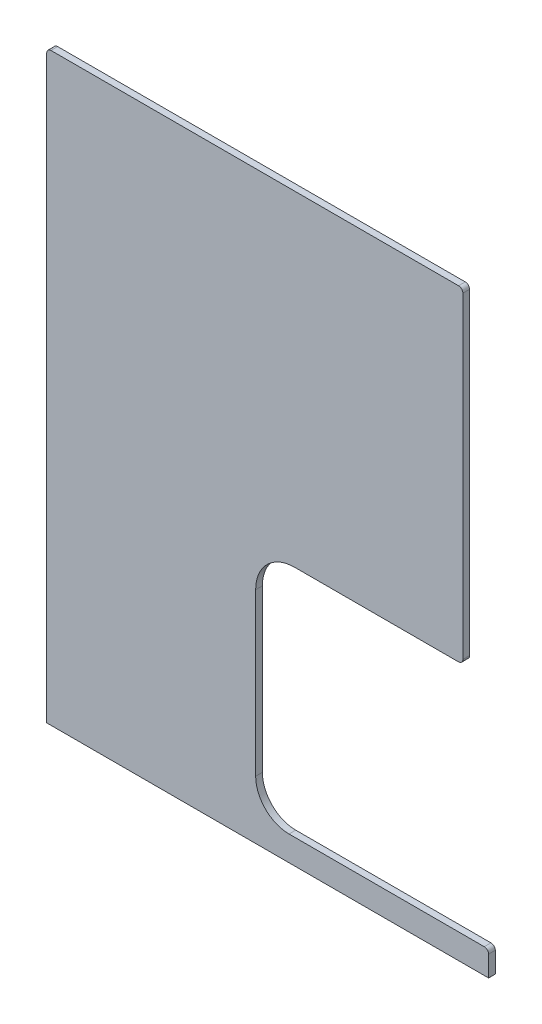
ISO-10303-21;
HEADER;
FILE_DESCRIPTION(('STEP AP214'),'2;1');
FILE_NAME('part.step','',(''),(''),'','','');
FILE_SCHEMA(('AUTOMOTIVE_DESIGN { 1 0 10303 214 1 1 1 1 }'));
ENDSEC;
DATA;
#1=APPLICATION_CONTEXT('core data for automotive mechanical design processes');
#2=APPLICATION_PROTOCOL_DEFINITION('international standard','automotive_design',2000,#1);
#3=PRODUCT_CONTEXT('',#1,'mechanical');
#4=PRODUCT('Part','Part','',(#3));
#5=PRODUCT_RELATED_PRODUCT_CATEGORY('part','',(#4));
#6=PRODUCT_DEFINITION_FORMATION('','',#4);
#7=PRODUCT_DEFINITION_CONTEXT('part definition',#1,'design');
#8=PRODUCT_DEFINITION('design','',#6,#7);
#9=PRODUCT_DEFINITION_SHAPE('','',#8);
#10=(LENGTH_UNIT() NAMED_UNIT(*) SI_UNIT(.MILLI.,.METRE.));
#11=(NAMED_UNIT(*) PLANE_ANGLE_UNIT() SI_UNIT($,.RADIAN.));
#12=(NAMED_UNIT(*) SI_UNIT($,.STERADIAN.) SOLID_ANGLE_UNIT());
#13=UNCERTAINTY_MEASURE_WITH_UNIT(LENGTH_MEASURE(1.E-05),#10,'distance_accuracy_value','');
#14=(GEOMETRIC_REPRESENTATION_CONTEXT(3) GLOBAL_UNCERTAINTY_ASSIGNED_CONTEXT((#13)) GLOBAL_UNIT_ASSIGNED_CONTEXT((#10,
#11,#12)) REPRESENTATION_CONTEXT('',''));
#15=CARTESIAN_POINT('',(0.,0.,0.));
#16=DIRECTION('',(0.,0.,1.));
#17=DIRECTION('',(1.,0.,0.));
#18=AXIS2_PLACEMENT_3D('',#15,#16,#17);
#19=CARTESIAN_POINT('',(0.,0.,8.6));
#20=DIRECTION('',(0.,1.,0.));
#21=DIRECTION('',(0.,0.,1.));
#22=AXIS2_PLACEMENT_3D('',#19,#20,#21);
#23=PLANE('',#22);
#24=DIRECTION('',(1.,0.,0.));
#25=VECTOR('',#24,1.);
#26=CARTESIAN_POINT('',(0.,0.,0.));
#27=LINE('',#26,#25);
#28=CARTESIAN_POINT('',(0.,0.,0.));
#29=VERTEX_POINT('',#28);
#30=CARTESIAN_POINT('',(567.,0.,0.));
#31=VERTEX_POINT('',#30);
#32=EDGE_CURVE('E165',#29,#31,#27,.T.);
#33=ORIENTED_EDGE('',*,*,#32,.T.);
#34=DIRECTION('',(0.,0.,-1.));
#35=VECTOR('',#34,1.);
#36=CARTESIAN_POINT('',(567.,0.,8.6));
#37=LINE('',#36,#35);
#38=CARTESIAN_POINT('',(567.,0.,8.6));
#39=VERTEX_POINT('',#38);
#40=EDGE_CURVE('E11',#39,#31,#37,.T.);
#41=ORIENTED_EDGE('',*,*,#40,.F.);
#42=DIRECTION('',(1.,0.,0.));
#43=VECTOR('',#42,1.);
#44=CARTESIAN_POINT('',(0.,0.,8.6));
#45=LINE('',#44,#43);
#46=CARTESIAN_POINT('',(0.,0.,8.6));
#47=VERTEX_POINT('',#46);
#48=EDGE_CURVE('E192',#47,#39,#45,.T.);
#49=ORIENTED_EDGE('',*,*,#48,.F.);
#50=DIRECTION('',(0.,0.,-1.));
#51=VECTOR('',#50,1.);
#52=CARTESIAN_POINT('',(0.,0.,8.6));
#53=LINE('',#52,#51);
#54=EDGE_CURVE('E161',#47,#29,#53,.T.);
#55=ORIENTED_EDGE('',*,*,#54,.T.);
#56=EDGE_LOOP('',(#33,#41,#49,#55));
#57=FACE_BOUND('',#56,.T.);
#58=ADVANCED_FACE('F33',(#57),#23,.F.);
#59=CARTESIAN_POINT('',(567.,0.,8.6));
#60=DIRECTION('',(-1.,0.,0.));
#61=DIRECTION('',(0.,0.,1.));
#62=AXIS2_PLACEMENT_3D('',#59,#60,#61);
#63=PLANE('',#62);
#64=DIRECTION('',(0.,1.,0.));
#65=VECTOR('',#64,1.);
#66=CARTESIAN_POINT('',(567.,0.,0.));
#67=LINE('',#66,#65);
#68=CARTESIAN_POINT('',(567.,26.4999999999999,0.));
#69=VERTEX_POINT('',#68);
#70=EDGE_CURVE('E168',#31,#69,#67,.T.);
#71=ORIENTED_EDGE('',*,*,#70,.T.);
#72=DIRECTION('',(0.,0.,-1.));
#73=VECTOR('',#72,1.);
#74=CARTESIAN_POINT('',(567.,26.4999999999999,8.6));
#75=LINE('',#74,#73);
#76=CARTESIAN_POINT('',(567.,26.4999999999999,8.6));
#77=VERTEX_POINT('',#76);
#78=EDGE_CURVE('E41',#77,#69,#75,.T.);
#79=ORIENTED_EDGE('',*,*,#78,.F.);
#80=DIRECTION('',(0.,1.,0.));
#81=VECTOR('',#80,1.);
#82=CARTESIAN_POINT('',(567.,0.,8.6));
#83=LINE('',#82,#81);
#84=EDGE_CURVE('E110',#39,#77,#83,.T.);
#85=ORIENTED_EDGE('',*,*,#84,.F.);
#86=ORIENTED_EDGE('',*,*,#40,.T.);
#87=EDGE_LOOP('',(#71,#79,#85,#86));
#88=FACE_BOUND('',#87,.T.);
#89=ADVANCED_FACE('F279',(#88),#63,.F.);
#90=CARTESIAN_POINT('',(561.5,26.5,8.6));
#91=DIRECTION('',(0.,0.,-1.));
#92=DIRECTION('',(-1.,0.,0.));
#93=AXIS2_PLACEMENT_3D('',#90,#91,#92);
#94=CYLINDRICAL_SURFACE('',#93,5.49999999999997);
#95=CARTESIAN_POINT('',(561.5,26.5,0.));
#96=DIRECTION('',(0.,0.,1.));
#97=DIRECTION('',(1.,0.,0.));
#98=AXIS2_PLACEMENT_3D('',#95,#96,#97);
#99=CIRCLE('',#98,5.49999999999997);
#100=CARTESIAN_POINT('',(561.5,32.,0.));
#101=VERTEX_POINT('',#100);
#102=EDGE_CURVE('E170',#69,#101,#99,.T.);
#103=ORIENTED_EDGE('',*,*,#102,.T.);
#104=DIRECTION('',(0.,0.,-1.));
#105=VECTOR('',#104,1.);
#106=CARTESIAN_POINT('',(561.5,32.,8.6));
#107=LINE('',#106,#105);
#108=CARTESIAN_POINT('',(561.5,32.,8.6));
#109=VERTEX_POINT('',#108);
#110=EDGE_CURVE('E217',#109,#101,#107,.T.);
#111=ORIENTED_EDGE('',*,*,#110,.F.);
#112=CARTESIAN_POINT('',(561.5,26.5,8.6));
#113=DIRECTION('',(0.,0.,1.));
#114=DIRECTION('',(1.,0.,0.));
#115=AXIS2_PLACEMENT_3D('',#112,#113,#114);
#116=CIRCLE('',#115,5.49999999999997);
#117=EDGE_CURVE('E225',#77,#109,#116,.T.);
#118=ORIENTED_EDGE('',*,*,#117,.F.);
#119=ORIENTED_EDGE('',*,*,#78,.T.);
#120=EDGE_LOOP('',(#103,#111,#118,#119));
#121=FACE_BOUND('',#120,.T.);
#122=ADVANCED_FACE('F223',(#121),#94,.T.);
#123=CARTESIAN_POINT('',(313.,32.,8.6));
#124=DIRECTION('',(0.,-1.,0.));
#125=DIRECTION('',(1.,0.,0.));
#126=AXIS2_PLACEMENT_3D('',#123,#124,#125);
#127=PLANE('',#126);
#128=DIRECTION('',(-1.,0.,0.));
#129=VECTOR('',#128,1.);
#130=CARTESIAN_POINT('',(313.,32.,0.));
#131=LINE('',#130,#129);
#132=CARTESIAN_POINT('',(310.9,32.,0.));
#133=VERTEX_POINT('',#132);
#134=EDGE_CURVE('E173',#101,#133,#131,.T.);
#135=ORIENTED_EDGE('',*,*,#134,.T.);
#136=DIRECTION('',(0.,0.,-1.));
#137=VECTOR('',#136,1.);
#138=CARTESIAN_POINT('',(310.9,32.,8.6));
#139=LINE('',#138,#137);
#140=CARTESIAN_POINT('',(310.9,32.,8.6));
#141=VERTEX_POINT('',#140);
#142=EDGE_CURVE('E214',#141,#133,#139,.T.);
#143=ORIENTED_EDGE('',*,*,#142,.F.);
#144=DIRECTION('',(-1.,0.,0.));
#145=VECTOR('',#144,1.);
#146=CARTESIAN_POINT('',(561.5,32.,8.6));
#147=LINE('',#146,#145);
#148=EDGE_CURVE('E242',#109,#141,#147,.T.);
#149=ORIENTED_EDGE('',*,*,#148,.F.);
#150=ORIENTED_EDGE('',*,*,#110,.T.);
#151=EDGE_LOOP('',(#135,#143,#149,#150));
#152=FACE_BOUND('',#151,.T.);
#153=ADVANCED_FACE('F233',(#152),#127,.F.);
#154=CARTESIAN_POINT('',(310.9,74.8,8.6));
#155=DIRECTION('',(0.,0.,-1.));
#156=DIRECTION('',(-1.,0.,0.));
#157=AXIS2_PLACEMENT_3D('',#154,#155,#156);
#158=CYLINDRICAL_SURFACE('',#157,42.8);
#159=CARTESIAN_POINT('',(310.9,74.8,0.));
#160=DIRECTION('',(0.,0.,-1.));
#161=DIRECTION('',(-1.,0.,0.));
#162=AXIS2_PLACEMENT_3D('',#159,#160,#161);
#163=CIRCLE('',#162,42.8);
#164=CARTESIAN_POINT('',(268.1,74.8000000000001,0.));
#165=VERTEX_POINT('',#164);
#166=EDGE_CURVE('E175',#133,#165,#163,.T.);
#167=ORIENTED_EDGE('',*,*,#166,.T.);
#168=DIRECTION('',(0.,0.,-1.));
#169=VECTOR('',#168,1.);
#170=CARTESIAN_POINT('',(268.1,74.8000000000001,8.6));
#171=LINE('',#170,#169);
#172=CARTESIAN_POINT('',(268.1,74.8000000000001,8.6));
#173=VERTEX_POINT('',#172);
#174=EDGE_CURVE('E211',#173,#165,#171,.T.);
#175=ORIENTED_EDGE('',*,*,#174,.F.);
#176=CARTESIAN_POINT('',(310.9,74.8,8.6));
#177=DIRECTION('',(0.,0.,-1.));
#178=DIRECTION('',(-1.,0.,0.));
#179=AXIS2_PLACEMENT_3D('',#176,#177,#178);
#180=CIRCLE('',#179,42.8);
#181=EDGE_CURVE('E239',#141,#173,#180,.T.);
#182=ORIENTED_EDGE('',*,*,#181,.F.);
#183=ORIENTED_EDGE('',*,*,#142,.T.);
#184=EDGE_LOOP('',(#167,#175,#182,#183));
#185=FACE_BOUND('',#184,.T.);
#186=ADVANCED_FACE('F237',(#185),#158,.F.);
#187=CARTESIAN_POINT('',(268.1,282.,8.6));
#188=DIRECTION('',(-1.,0.,0.));
#189=DIRECTION('',(0.,0.,1.));
#190=AXIS2_PLACEMENT_3D('',#187,#188,#189);
#191=PLANE('',#190);
#192=DIRECTION('',(0.,1.,0.));
#193=VECTOR('',#192,1.);
#194=CARTESIAN_POINT('',(268.1,282.,0.));
#195=LINE('',#194,#193);
#196=CARTESIAN_POINT('',(268.1,282.,0.));
#197=VERTEX_POINT('',#196);
#198=EDGE_CURVE('E177',#165,#197,#195,.T.);
#199=ORIENTED_EDGE('',*,*,#198,.T.);
#200=DIRECTION('',(0.,0.,-1.));
#201=VECTOR('',#200,1.);
#202=CARTESIAN_POINT('',(268.1,282.,8.6));
#203=LINE('',#202,#201);
#204=CARTESIAN_POINT('',(268.1,282.,8.6));
#205=VERTEX_POINT('',#204);
#206=EDGE_CURVE('E208',#205,#197,#203,.T.);
#207=ORIENTED_EDGE('',*,*,#206,.F.);
#208=DIRECTION('',(0.,1.,0.));
#209=VECTOR('',#208,1.);
#210=CARTESIAN_POINT('',(268.1,282.,8.6));
#211=LINE('',#210,#209);
#212=EDGE_CURVE('E241',#173,#205,#211,.T.);
#213=ORIENTED_EDGE('',*,*,#212,.F.);
#214=ORIENTED_EDGE('',*,*,#174,.T.);
#215=EDGE_LOOP('',(#199,#207,#213,#214));
#216=FACE_BOUND('',#215,.T.);
#217=ADVANCED_FACE('F292',(#216),#191,.F.);
#218=CARTESIAN_POINT('',(318.1,282.,8.6));
#219=DIRECTION('',(0.,0.,-1.));
#220=DIRECTION('',(-1.,0.,0.));
#221=AXIS2_PLACEMENT_3D('',#218,#219,#220);
#222=CYLINDRICAL_SURFACE('',#221,50.0000000000001);
#223=CARTESIAN_POINT('',(318.1,282.,0.));
#224=DIRECTION('',(0.,0.,-1.));
#225=DIRECTION('',(1.,0.,0.));
#226=AXIS2_PLACEMENT_3D('',#223,#224,#225);
#227=CIRCLE('',#226,50.0000000000001);
#228=CARTESIAN_POINT('',(318.1,332.,0.));
#229=VERTEX_POINT('',#228);
#230=EDGE_CURVE('E179',#197,#229,#227,.T.);
#231=ORIENTED_EDGE('',*,*,#230,.T.);
#232=DIRECTION('',(0.,0.,-1.));
#233=VECTOR('',#232,1.);
#234=CARTESIAN_POINT('',(318.1,332.,8.6));
#235=LINE('',#234,#233);
#236=CARTESIAN_POINT('',(318.1,332.,8.6));
#237=VERTEX_POINT('',#236);
#238=EDGE_CURVE('E205',#237,#229,#235,.T.);
#239=ORIENTED_EDGE('',*,*,#238,.F.);
#240=CARTESIAN_POINT('',(318.1,282.,8.6));
#241=DIRECTION('',(0.,0.,-1.));
#242=DIRECTION('',(1.,0.,0.));
#243=AXIS2_PLACEMENT_3D('',#240,#241,#242);
#244=CIRCLE('',#243,50.0000000000001);
#245=EDGE_CURVE('E244',#205,#237,#244,.T.);
#246=ORIENTED_EDGE('',*,*,#245,.F.);
#247=ORIENTED_EDGE('',*,*,#206,.T.);
#248=EDGE_LOOP('',(#231,#239,#246,#247));
#249=FACE_BOUND('',#248,.T.);
#250=ADVANCED_FACE('F295',(#249),#222,.F.);
#251=CARTESIAN_POINT('',(528.5,332.,8.6));
#252=DIRECTION('',(0.,1.,0.));
#253=DIRECTION('',(0.,0.,1.));
#254=AXIS2_PLACEMENT_3D('',#251,#252,#253);
#255=PLANE('',#254);
#256=DIRECTION('',(1.,0.,0.));
#257=VECTOR('',#256,1.);
#258=CARTESIAN_POINT('',(528.5,332.,0.));
#259=LINE('',#258,#257);
#260=CARTESIAN_POINT('',(528.5,332.,0.));
#261=VERTEX_POINT('',#260);
#262=EDGE_CURVE('E181',#229,#261,#259,.T.);
#263=ORIENTED_EDGE('',*,*,#262,.T.);
#264=DIRECTION('',(0.,0.,-1.));
#265=VECTOR('',#264,1.);
#266=CARTESIAN_POINT('',(528.5,332.,8.6));
#267=LINE('',#266,#265);
#268=CARTESIAN_POINT('',(528.5,332.,8.6));
#269=VERTEX_POINT('',#268);
#270=EDGE_CURVE('E202',#269,#261,#267,.T.);
#271=ORIENTED_EDGE('',*,*,#270,.F.);
#272=DIRECTION('',(1.,0.,0.));
#273=VECTOR('',#272,1.);
#274=CARTESIAN_POINT('',(528.5,332.,8.6));
#275=LINE('',#274,#273);
#276=EDGE_CURVE('E250',#237,#269,#275,.T.);
#277=ORIENTED_EDGE('',*,*,#276,.F.);
#278=ORIENTED_EDGE('',*,*,#238,.T.);
#279=EDGE_LOOP('',(#263,#271,#277,#278));
#280=FACE_BOUND('',#279,.T.);
#281=ADVANCED_FACE('F299',(#280),#255,.F.);
#282=CARTESIAN_POINT('',(528.5,337.5,8.6));
#283=DIRECTION('',(0.,0.,-1.));
#284=DIRECTION('',(-1.,0.,0.));
#285=AXIS2_PLACEMENT_3D('',#282,#283,#284);
#286=CYLINDRICAL_SURFACE('',#285,5.49999999999998);
#287=CARTESIAN_POINT('',(528.5,337.5,0.));
#288=DIRECTION('',(0.,0.,1.));
#289=DIRECTION('',(-1.,0.,0.));
#290=AXIS2_PLACEMENT_3D('',#287,#288,#289);
#291=CIRCLE('',#290,5.49999999999998);
#292=CARTESIAN_POINT('',(534.,337.5,0.));
#293=VERTEX_POINT('',#292);
#294=EDGE_CURVE('E183',#261,#293,#291,.T.);
#295=ORIENTED_EDGE('',*,*,#294,.T.);
#296=DIRECTION('',(0.,0.,-1.));
#297=VECTOR('',#296,1.);
#298=CARTESIAN_POINT('',(534.,337.5,8.6));
#299=LINE('',#298,#297);
#300=CARTESIAN_POINT('',(534.,337.5,8.6));
#301=VERTEX_POINT('',#300);
#302=EDGE_CURVE('E199',#301,#293,#299,.T.);
#303=ORIENTED_EDGE('',*,*,#302,.F.);
#304=CARTESIAN_POINT('',(528.5,337.5,8.6));
#305=DIRECTION('',(0.,0.,1.));
#306=DIRECTION('',(-1.,0.,0.));
#307=AXIS2_PLACEMENT_3D('',#304,#305,#306);
#308=CIRCLE('',#307,5.49999999999998);
#309=EDGE_CURVE('E252',#269,#301,#308,.T.);
#310=ORIENTED_EDGE('',*,*,#309,.F.);
#311=ORIENTED_EDGE('',*,*,#270,.T.);
#312=EDGE_LOOP('',(#295,#303,#310,#311));
#313=FACE_BOUND('',#312,.T.);
#314=ADVANCED_FACE('F303',(#313),#286,.T.);
#315=CARTESIAN_POINT('',(534.,744.5,8.6));
#316=DIRECTION('',(-1.,0.,0.));
#317=DIRECTION('',(0.,0.,1.));
#318=AXIS2_PLACEMENT_3D('',#315,#316,#317);
#319=PLANE('',#318);
#320=DIRECTION('',(0.,1.,0.));
#321=VECTOR('',#320,1.);
#322=CARTESIAN_POINT('',(534.,744.5,0.));
#323=LINE('',#322,#321);
#324=CARTESIAN_POINT('',(534.,744.5,0.));
#325=VERTEX_POINT('',#324);
#326=EDGE_CURVE('E185',#293,#325,#323,.T.);
#327=ORIENTED_EDGE('',*,*,#326,.T.);
#328=DIRECTION('',(0.,0.,-1.));
#329=VECTOR('',#328,1.);
#330=CARTESIAN_POINT('',(534.,744.5,8.6));
#331=LINE('',#330,#329);
#332=CARTESIAN_POINT('',(534.,744.5,8.6));
#333=VERTEX_POINT('',#332);
#334=EDGE_CURVE('E196',#333,#325,#331,.T.);
#335=ORIENTED_EDGE('',*,*,#334,.F.);
#336=DIRECTION('',(0.,1.,0.));
#337=VECTOR('',#336,1.);
#338=CARTESIAN_POINT('',(534.,744.5,8.6));
#339=LINE('',#338,#337);
#340=EDGE_CURVE('E254',#301,#333,#339,.T.);
#341=ORIENTED_EDGE('',*,*,#340,.F.);
#342=ORIENTED_EDGE('',*,*,#302,.T.);
#343=EDGE_LOOP('',(#327,#335,#341,#342));
#344=FACE_BOUND('',#343,.T.);
#345=ADVANCED_FACE('F260',(#344),#319,.F.);
#346=CARTESIAN_POINT('',(528.5,744.5,8.6));
#347=DIRECTION('',(0.,0.,-1.));
#348=DIRECTION('',(-1.,0.,0.));
#349=AXIS2_PLACEMENT_3D('',#346,#347,#348);
#350=CYLINDRICAL_SURFACE('',#349,5.49999999999995);
#351=CARTESIAN_POINT('',(528.5,744.5,0.));
#352=DIRECTION('',(0.,0.,1.));
#353=DIRECTION('',(-1.,0.,0.));
#354=AXIS2_PLACEMENT_3D('',#351,#352,#353);
#355=CIRCLE('',#354,5.49999999999995);
#356=CARTESIAN_POINT('',(528.5,750.,0.));
#357=VERTEX_POINT('',#356);
#358=EDGE_CURVE('E187',#325,#357,#355,.T.);
#359=ORIENTED_EDGE('',*,*,#358,.T.);
#360=DIRECTION('',(0.,0.,-1.));
#361=VECTOR('',#360,1.);
#362=CARTESIAN_POINT('',(528.5,750.,8.6));
#363=LINE('',#362,#361);
#364=CARTESIAN_POINT('',(528.5,750.,8.6));
#365=VERTEX_POINT('',#364);
#366=EDGE_CURVE('E156',#365,#357,#363,.T.);
#367=ORIENTED_EDGE('',*,*,#366,.F.);
#368=CARTESIAN_POINT('',(528.5,744.5,8.6));
#369=DIRECTION('',(0.,0.,1.));
#370=DIRECTION('',(-1.,0.,0.));
#371=AXIS2_PLACEMENT_3D('',#368,#369,#370);
#372=CIRCLE('',#371,5.49999999999995);
#373=EDGE_CURVE('E147',#333,#365,#372,.T.);
#374=ORIENTED_EDGE('',*,*,#373,.F.);
#375=ORIENTED_EDGE('',*,*,#334,.T.);
#376=EDGE_LOOP('',(#359,#367,#374,#375));
#377=FACE_BOUND('',#376,.T.);
#378=ADVANCED_FACE('F264',(#377),#350,.T.);
#379=CARTESIAN_POINT('',(5.50000000000004,750.,8.6));
#380=DIRECTION('',(0.,-1.,0.));
#381=DIRECTION('',(0.,0.,-1.));
#382=AXIS2_PLACEMENT_3D('',#379,#380,#381);
#383=PLANE('',#382);
#384=DIRECTION('',(-1.,0.,0.));
#385=VECTOR('',#384,1.);
#386=CARTESIAN_POINT('',(5.50000000000004,750.,0.));
#387=LINE('',#386,#385);
#388=CARTESIAN_POINT('',(5.50000000000004,750.,0.));
#389=VERTEX_POINT('',#388);
#390=EDGE_CURVE('E155',#357,#389,#387,.T.);
#391=ORIENTED_EDGE('',*,*,#390,.T.);
#392=DIRECTION('',(0.,0.,-1.));
#393=VECTOR('',#392,1.);
#394=CARTESIAN_POINT('',(5.50000000000004,750.,8.6));
#395=LINE('',#394,#393);
#396=CARTESIAN_POINT('',(5.50000000000004,750.,8.6));
#397=VERTEX_POINT('',#396);
#398=EDGE_CURVE('E152',#397,#389,#395,.T.);
#399=ORIENTED_EDGE('',*,*,#398,.F.);
#400=DIRECTION('',(-1.,0.,0.));
#401=VECTOR('',#400,1.);
#402=CARTESIAN_POINT('',(5.50000000000004,750.,8.6));
#403=LINE('',#402,#401);
#404=EDGE_CURVE('E141',#365,#397,#403,.T.);
#405=ORIENTED_EDGE('',*,*,#404,.F.);
#406=ORIENTED_EDGE('',*,*,#366,.T.);
#407=EDGE_LOOP('',(#391,#399,#405,#406));
#408=FACE_BOUND('',#407,.T.);
#409=ADVANCED_FACE('F153',(#408),#383,.F.);
#410=CARTESIAN_POINT('',(5.5,744.5,8.6));
#411=DIRECTION('',(0.,0.,-1.));
#412=DIRECTION('',(-1.,0.,0.));
#413=AXIS2_PLACEMENT_3D('',#410,#411,#412);
#414=CYLINDRICAL_SURFACE('',#413,5.49999999999997);
#415=CARTESIAN_POINT('',(5.5,744.5,0.));
#416=DIRECTION('',(0.,0.,1.));
#417=DIRECTION('',(-1.,0.,0.));
#418=AXIS2_PLACEMENT_3D('',#415,#416,#417);
#419=CIRCLE('',#418,5.49999999999997);
#420=CARTESIAN_POINT('',(0.,744.5,0.));
#421=VERTEX_POINT('',#420);
#422=EDGE_CURVE('E96',#389,#421,#419,.T.);
#423=ORIENTED_EDGE('',*,*,#422,.T.);
#424=DIRECTION('',(0.,0.,-1.));
#425=VECTOR('',#424,1.);
#426=CARTESIAN_POINT('',(0.,744.5,8.6));
#427=LINE('',#426,#425);
#428=CARTESIAN_POINT('',(0.,744.5,8.6));
#429=VERTEX_POINT('',#428);
#430=EDGE_CURVE('E157',#429,#421,#427,.T.);
#431=ORIENTED_EDGE('',*,*,#430,.F.);
#432=CARTESIAN_POINT('',(5.5,744.5,8.6));
#433=DIRECTION('',(0.,0.,1.));
#434=DIRECTION('',(-1.,0.,0.));
#435=AXIS2_PLACEMENT_3D('',#432,#433,#434);
#436=CIRCLE('',#435,5.49999999999997);
#437=EDGE_CURVE('E145',#397,#429,#436,.T.);
#438=ORIENTED_EDGE('',*,*,#437,.F.);
#439=ORIENTED_EDGE('',*,*,#398,.T.);
#440=EDGE_LOOP('',(#423,#431,#438,#439));
#441=FACE_BOUND('',#440,.T.);
#442=ADVANCED_FACE('F159',(#441),#414,.T.);
#443=CARTESIAN_POINT('',(0.,0.,8.6));
#444=DIRECTION('',(1.,0.,0.));
#445=DIRECTION('',(0.,0.,-1.));
#446=AXIS2_PLACEMENT_3D('',#443,#444,#445);
#447=PLANE('',#446);
#448=DIRECTION('',(0.,-1.,0.));
#449=VECTOR('',#448,1.);
#450=CARTESIAN_POINT('',(0.,0.,0.));
#451=LINE('',#450,#449);
#452=EDGE_CURVE('E102',#421,#29,#451,.T.);
#453=ORIENTED_EDGE('',*,*,#452,.T.);
#454=ORIENTED_EDGE('',*,*,#54,.F.);
#455=DIRECTION('',(0.,-1.,0.));
#456=VECTOR('',#455,1.);
#457=CARTESIAN_POINT('',(0.,0.,8.6));
#458=LINE('',#457,#456);
#459=EDGE_CURVE('E49',#429,#47,#458,.T.);
#460=ORIENTED_EDGE('',*,*,#459,.F.);
#461=ORIENTED_EDGE('',*,*,#430,.T.);
#462=EDGE_LOOP('',(#453,#454,#460,#461));
#463=FACE_BOUND('',#462,.T.);
#464=ADVANCED_FACE('F268',(#463),#447,.F.);
#465=CARTESIAN_POINT('',(561.5,26.5,8.6));
#466=DIRECTION('',(0.,0.,1.));
#467=DIRECTION('',(1.,0.,0.));
#468=AXIS2_PLACEMENT_3D('',#465,#466,#467);
#469=PLANE('',#468);
#470=ORIENTED_EDGE('',*,*,#48,.T.);
#471=ORIENTED_EDGE('',*,*,#84,.T.);
#472=ORIENTED_EDGE('',*,*,#117,.T.);
#473=ORIENTED_EDGE('',*,*,#148,.T.);
#474=ORIENTED_EDGE('',*,*,#181,.T.);
#475=ORIENTED_EDGE('',*,*,#212,.T.);
#476=ORIENTED_EDGE('',*,*,#245,.T.);
#477=ORIENTED_EDGE('',*,*,#276,.T.);
#478=ORIENTED_EDGE('',*,*,#309,.T.);
#479=ORIENTED_EDGE('',*,*,#340,.T.);
#480=ORIENTED_EDGE('',*,*,#373,.T.);
#481=ORIENTED_EDGE('',*,*,#404,.T.);
#482=ORIENTED_EDGE('',*,*,#437,.T.);
#483=ORIENTED_EDGE('',*,*,#459,.T.);
#484=EDGE_LOOP('',(#470,#471,#472,#473,#474,#475,#476,#477,#478,#479,#480,#481,#482,#483));
#485=FACE_BOUND('',#484,.T.);
#486=ADVANCED_FACE('F143',(#485),#469,.T.);
#487=CARTESIAN_POINT('',(561.5,26.5,0.));
#488=DIRECTION('',(0.,0.,1.));
#489=DIRECTION('',(1.,0.,0.));
#490=AXIS2_PLACEMENT_3D('',#487,#488,#489);
#491=PLANE('',#490);
#492=ORIENTED_EDGE('',*,*,#32,.F.);
#493=ORIENTED_EDGE('',*,*,#452,.F.);
#494=ORIENTED_EDGE('',*,*,#422,.F.);
#495=ORIENTED_EDGE('',*,*,#390,.F.);
#496=ORIENTED_EDGE('',*,*,#358,.F.);
#497=ORIENTED_EDGE('',*,*,#326,.F.);
#498=ORIENTED_EDGE('',*,*,#294,.F.);
#499=ORIENTED_EDGE('',*,*,#262,.F.);
#500=ORIENTED_EDGE('',*,*,#230,.F.);
#501=ORIENTED_EDGE('',*,*,#198,.F.);
#502=ORIENTED_EDGE('',*,*,#166,.F.);
#503=ORIENTED_EDGE('',*,*,#134,.F.);
#504=ORIENTED_EDGE('',*,*,#102,.F.);
#505=ORIENTED_EDGE('',*,*,#70,.F.);
#506=EDGE_LOOP('',(#492,#493,#494,#495,#496,#497,#498,#499,#500,#501,#502,#503,#504,#505));
#507=FACE_BOUND('',#506,.T.);
#508=ADVANCED_FACE('F228',(#507),#491,.F.);
#509=CLOSED_SHELL('',(#58,#89,#122,#153,#186,#217,#250,#281,#314,#345,#378,#409,#442,#464,#486,#508));
#510=MANIFOLD_SOLID_BREP('B2',#509);
#511=ADVANCED_BREP_SHAPE_REPRESENTATION('',(#18,#510),#14);
#512=SHAPE_DEFINITION_REPRESENTATION(#9,#511);
ENDSEC;
END-ISO-10303-21;
